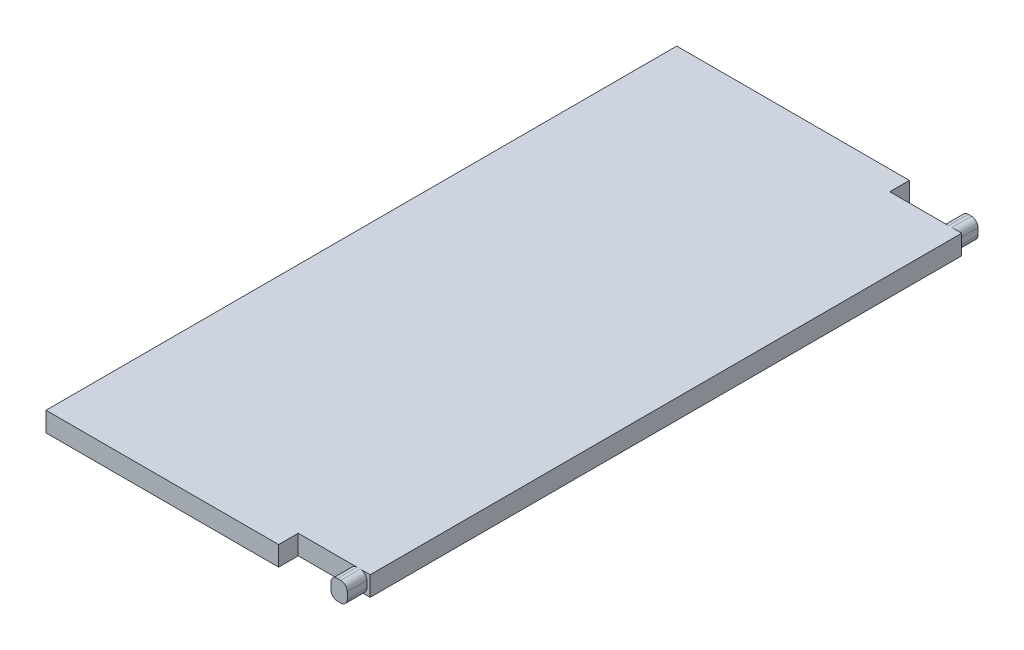
ISO-10303-21;
HEADER;
FILE_DESCRIPTION(('STEP AP214'),'2;1');
FILE_NAME('part.step','',(''),(''),'','','');
FILE_SCHEMA(('AUTOMOTIVE_DESIGN { 1 0 10303 214 1 1 1 1 }'));
ENDSEC;
DATA;
#1=APPLICATION_CONTEXT('core data for automotive mechanical design processes');
#2=APPLICATION_PROTOCOL_DEFINITION('international standard','automotive_design',2000,#1);
#3=PRODUCT_CONTEXT('',#1,'mechanical');
#4=PRODUCT('Part','Part','',(#3));
#5=PRODUCT_RELATED_PRODUCT_CATEGORY('part','',(#4));
#6=PRODUCT_DEFINITION_FORMATION('','',#4);
#7=PRODUCT_DEFINITION_CONTEXT('part definition',#1,'design');
#8=PRODUCT_DEFINITION('design','',#6,#7);
#9=PRODUCT_DEFINITION_SHAPE('','',#8);
#10=(LENGTH_UNIT() NAMED_UNIT(*) SI_UNIT(.MILLI.,.METRE.));
#11=(NAMED_UNIT(*) PLANE_ANGLE_UNIT() SI_UNIT($,.RADIAN.));
#12=(NAMED_UNIT(*) SI_UNIT($,.STERADIAN.) SOLID_ANGLE_UNIT());
#13=UNCERTAINTY_MEASURE_WITH_UNIT(LENGTH_MEASURE(1.E-05),#10,'distance_accuracy_value','');
#14=(GEOMETRIC_REPRESENTATION_CONTEXT(3) GLOBAL_UNCERTAINTY_ASSIGNED_CONTEXT((#13)) GLOBAL_UNIT_ASSIGNED_CONTEXT((#10,
#11,#12)) REPRESENTATION_CONTEXT('',''));
#15=CARTESIAN_POINT('',(0.,0.,0.));
#16=DIRECTION('',(0.,0.,1.));
#17=DIRECTION('',(1.,0.,0.));
#18=AXIS2_PLACEMENT_3D('',#15,#16,#17);
#19=CARTESIAN_POINT('',(0.,3.,0.));
#20=DIRECTION('',(0.,1.,0.));
#21=DIRECTION('',(0.,0.,1.));
#22=AXIS2_PLACEMENT_3D('',#19,#20,#21);
#23=PLANE('',#22);
#24=DIRECTION('',(-1.,0.,0.));
#25=VECTOR('',#24,1.);
#26=CARTESIAN_POINT('',(-31.925,3.,-48.26));
#27=LINE('',#26,#25);
#28=CARTESIAN_POINT('',(20.925,3.,-48.26));
#29=VERTEX_POINT('',#28);
#30=CARTESIAN_POINT('',(-14.675,3.,-48.26));
#31=VERTEX_POINT('',#30);
#32=EDGE_CURVE('E392',#29,#31,#27,.T.);
#33=ORIENTED_EDGE('',*,*,#32,.T.);
#34=DIRECTION('',(0.,0.,-1.));
#35=VECTOR('',#34,1.);
#36=CARTESIAN_POINT('',(-14.675,3.,-48.26));
#37=LINE('',#36,#35);
#38=CARTESIAN_POINT('',(-14.675,3.,48.26));
#39=VERTEX_POINT('',#38);
#40=EDGE_CURVE('E199',#39,#31,#37,.T.);
#41=ORIENTED_EDGE('',*,*,#40,.F.);
#42=DIRECTION('',(1.,0.,0.));
#43=VECTOR('',#42,1.);
#44=CARTESIAN_POINT('',(-31.925,3.,48.26));
#45=LINE('',#44,#43);
#46=CARTESIAN_POINT('',(20.925,3.,48.26));
#47=VERTEX_POINT('',#46);
#48=EDGE_CURVE('E233',#39,#47,#45,.T.);
#49=ORIENTED_EDGE('',*,*,#48,.T.);
#50=DIRECTION('',(0.,0.,1.));
#51=VECTOR('',#50,1.);
#52=CARTESIAN_POINT('',(20.925,3.,45.26));
#53=LINE('',#52,#51);
#54=CARTESIAN_POINT('',(20.925,3.,45.26));
#55=VERTEX_POINT('',#54);
#56=EDGE_CURVE('E382',#55,#47,#53,.T.);
#57=ORIENTED_EDGE('',*,*,#56,.F.);
#58=DIRECTION('',(-1.,0.,0.));
#59=VECTOR('',#58,1.);
#60=CARTESIAN_POINT('',(0.,3.,45.26));
#61=LINE('',#60,#59);
#62=CARTESIAN_POINT('',(29.925,3.,45.26));
#63=VERTEX_POINT('',#62);
#64=EDGE_CURVE('E371',#63,#55,#61,.T.);
#65=ORIENTED_EDGE('',*,*,#64,.F.);
#66=DIRECTION('',(0.,0.,1.));
#67=VECTOR('',#66,1.);
#68=CARTESIAN_POINT('',(29.925,3.,0.));
#69=LINE('',#68,#67);
#70=CARTESIAN_POINT('',(29.925,3.,48.26));
#71=VERTEX_POINT('',#70);
#72=EDGE_CURVE('E252',#63,#71,#69,.T.);
#73=ORIENTED_EDGE('',*,*,#72,.T.);
#74=CARTESIAN_POINT('',(30.425,3.,48.26));
#75=VERTEX_POINT('',#74);
#76=EDGE_CURVE('E395',#71,#75,#45,.T.);
#77=ORIENTED_EDGE('',*,*,#76,.T.);
#78=DIRECTION('',(0.,0.,-1.));
#79=VECTOR('',#78,1.);
#80=CARTESIAN_POINT('',(30.425,3.,0.));
#81=LINE('',#80,#79);
#82=CARTESIAN_POINT('',(30.425,3.,45.26));
#83=VERTEX_POINT('',#82);
#84=EDGE_CURVE('E249',#75,#83,#81,.T.);
#85=ORIENTED_EDGE('',*,*,#84,.T.);
#86=DIRECTION('',(1.,0.,0.));
#87=VECTOR('',#86,1.);
#88=CARTESIAN_POINT('',(-31.925,3.,45.26));
#89=LINE('',#88,#87);
#90=CARTESIAN_POINT('',(31.925,3.,45.26));
#91=VERTEX_POINT('',#90);
#92=EDGE_CURVE('E364',#83,#91,#89,.T.);
#93=ORIENTED_EDGE('',*,*,#92,.T.);
#94=DIRECTION('',(0.,0.,-1.));
#95=VECTOR('',#94,1.);
#96=CARTESIAN_POINT('',(31.925,3.,-48.26));
#97=LINE('',#96,#95);
#98=CARTESIAN_POINT('',(31.925,3.,-45.26));
#99=VERTEX_POINT('',#98);
#100=EDGE_CURVE('E229',#91,#99,#97,.T.);
#101=ORIENTED_EDGE('',*,*,#100,.T.);
#102=DIRECTION('',(1.,0.,0.));
#103=VECTOR('',#102,1.);
#104=CARTESIAN_POINT('',(31.425,3.,-45.26));
#105=LINE('',#104,#103);
#106=CARTESIAN_POINT('',(30.425,3.,-45.26));
#107=VERTEX_POINT('',#106);
#108=EDGE_CURVE('E342',#107,#99,#105,.T.);
#109=ORIENTED_EDGE('',*,*,#108,.F.);
#110=DIRECTION('',(0.,0.,-1.));
#111=VECTOR('',#110,1.);
#112=CARTESIAN_POINT('',(30.425,3.,-48.26));
#113=LINE('',#112,#111);
#114=CARTESIAN_POINT('',(30.425,3.,-48.26));
#115=VERTEX_POINT('',#114);
#116=EDGE_CURVE('E292',#107,#115,#113,.T.);
#117=ORIENTED_EDGE('',*,*,#116,.T.);
#118=CARTESIAN_POINT('',(29.925,3.,-48.26));
#119=VERTEX_POINT('',#118);
#120=EDGE_CURVE('E393',#115,#119,#27,.T.);
#121=ORIENTED_EDGE('',*,*,#120,.T.);
#122=DIRECTION('',(0.,0.,-1.));
#123=VECTOR('',#122,1.);
#124=CARTESIAN_POINT('',(29.925,3.,-45.26));
#125=LINE('',#124,#123);
#126=CARTESIAN_POINT('',(29.925,3.,-45.26));
#127=VERTEX_POINT('',#126);
#128=EDGE_CURVE('E289',#119,#127,#125,.F.);
#129=ORIENTED_EDGE('',*,*,#128,.T.);
#130=DIRECTION('',(-1.,0.,0.));
#131=VECTOR('',#130,1.);
#132=CARTESIAN_POINT('',(0.,3.,-45.26));
#133=LINE('',#132,#131);
#134=CARTESIAN_POINT('',(20.925,3.,-45.26));
#135=VERTEX_POINT('',#134);
#136=EDGE_CURVE('E343',#127,#135,#133,.T.);
#137=ORIENTED_EDGE('',*,*,#136,.T.);
#138=DIRECTION('',(0.,0.,-1.));
#139=VECTOR('',#138,1.);
#140=CARTESIAN_POINT('',(20.925,3.,-45.26));
#141=LINE('',#140,#139);
#142=EDGE_CURVE('E352',#135,#29,#141,.T.);
#143=ORIENTED_EDGE('',*,*,#142,.T.);
#144=EDGE_LOOP('',(#33,#41,#49,#57,#65,#73,#77,#85,#93,#101,#109,#117,#121,#129,#137,#143));
#145=FACE_BOUND('',#144,.T.);
#146=ADVANCED_FACE('F36',(#145),#23,.T.);
#147=CARTESIAN_POINT('',(0.,0.,0.));
#148=DIRECTION('',(0.,1.,0.));
#149=DIRECTION('',(0.,0.,1.));
#150=AXIS2_PLACEMENT_3D('',#147,#148,#149);
#151=PLANE('',#150);
#152=DIRECTION('',(0.,0.,1.));
#153=VECTOR('',#152,1.);
#154=CARTESIAN_POINT('',(-14.675,0.,-48.26));
#155=LINE('',#154,#153);
#156=CARTESIAN_POINT('',(-14.675,0.,-48.26));
#157=VERTEX_POINT('',#156);
#158=CARTESIAN_POINT('',(-14.675,0.,48.26));
#159=VERTEX_POINT('',#158);
#160=EDGE_CURVE('E51',#157,#159,#155,.T.);
#161=ORIENTED_EDGE('',*,*,#160,.F.);
#162=DIRECTION('',(-1.,0.,0.));
#163=VECTOR('',#162,1.);
#164=CARTESIAN_POINT('',(-31.925,0.,-48.26));
#165=LINE('',#164,#163);
#166=CARTESIAN_POINT('',(20.925,0.,-48.26));
#167=VERTEX_POINT('',#166);
#168=EDGE_CURVE('E210',#167,#157,#165,.T.);
#169=ORIENTED_EDGE('',*,*,#168,.F.);
#170=DIRECTION('',(0.,0.,-1.));
#171=VECTOR('',#170,1.);
#172=CARTESIAN_POINT('',(20.925,0.,-45.26));
#173=LINE('',#172,#171);
#174=CARTESIAN_POINT('',(20.925,0.,-45.26));
#175=VERTEX_POINT('',#174);
#176=EDGE_CURVE('E349',#175,#167,#173,.T.);
#177=ORIENTED_EDGE('',*,*,#176,.F.);
#178=DIRECTION('',(1.,0.,0.));
#179=VECTOR('',#178,1.);
#180=CARTESIAN_POINT('',(0.,0.,-45.26));
#181=LINE('',#180,#179);
#182=CARTESIAN_POINT('',(29.925,0.,-45.26));
#183=VERTEX_POINT('',#182);
#184=EDGE_CURVE('E309',#175,#183,#181,.T.);
#185=ORIENTED_EDGE('',*,*,#184,.T.);
#186=DIRECTION('',(0.,0.,-1.));
#187=VECTOR('',#186,1.);
#188=CARTESIAN_POINT('',(29.925,0.,0.));
#189=LINE('',#188,#187);
#190=CARTESIAN_POINT('',(29.925,0.,-48.26));
#191=VERTEX_POINT('',#190);
#192=EDGE_CURVE('E283',#183,#191,#189,.T.);
#193=ORIENTED_EDGE('',*,*,#192,.T.);
#194=CARTESIAN_POINT('',(30.425,0.,-48.26));
#195=VERTEX_POINT('',#194);
#196=EDGE_CURVE('E218',#195,#191,#165,.T.);
#197=ORIENTED_EDGE('',*,*,#196,.F.);
#198=DIRECTION('',(0.,0.,-1.));
#199=VECTOR('',#198,1.);
#200=CARTESIAN_POINT('',(30.425,0.,0.));
#201=LINE('',#200,#199);
#202=CARTESIAN_POINT('',(30.425,0.,-45.26));
#203=VERTEX_POINT('',#202);
#204=EDGE_CURVE('E286',#195,#203,#201,.F.);
#205=ORIENTED_EDGE('',*,*,#204,.T.);
#206=DIRECTION('',(-1.,0.,0.));
#207=VECTOR('',#206,1.);
#208=CARTESIAN_POINT('',(31.925,0.,-45.26));
#209=LINE('',#208,#207);
#210=CARTESIAN_POINT('',(31.925,0.,-45.26));
#211=VERTEX_POINT('',#210);
#212=EDGE_CURVE('E334',#211,#203,#209,.T.);
#213=ORIENTED_EDGE('',*,*,#212,.F.);
#214=DIRECTION('',(0.,0.,-1.));
#215=VECTOR('',#214,1.);
#216=CARTESIAN_POINT('',(31.925,0.,-48.26));
#217=LINE('',#216,#215);
#218=CARTESIAN_POINT('',(31.925,0.,45.26));
#219=VERTEX_POINT('',#218);
#220=EDGE_CURVE('E219',#219,#211,#217,.T.);
#221=ORIENTED_EDGE('',*,*,#220,.F.);
#222=DIRECTION('',(1.,0.,0.));
#223=VECTOR('',#222,1.);
#224=CARTESIAN_POINT('',(-31.925,0.,45.26));
#225=LINE('',#224,#223);
#226=CARTESIAN_POINT('',(30.425,0.,45.26));
#227=VERTEX_POINT('',#226);
#228=EDGE_CURVE('E355',#227,#219,#225,.T.);
#229=ORIENTED_EDGE('',*,*,#228,.F.);
#230=DIRECTION('',(0.,0.,-1.));
#231=VECTOR('',#230,1.);
#232=CARTESIAN_POINT('',(30.425,0.,48.26));
#233=LINE('',#232,#231);
#234=CARTESIAN_POINT('',(30.425,0.,48.26));
#235=VERTEX_POINT('',#234);
#236=EDGE_CURVE('E244',#227,#235,#233,.F.);
#237=ORIENTED_EDGE('',*,*,#236,.T.);
#238=DIRECTION('',(1.,0.,0.));
#239=VECTOR('',#238,1.);
#240=CARTESIAN_POINT('',(-31.925,0.,48.26));
#241=LINE('',#240,#239);
#242=CARTESIAN_POINT('',(29.925,0.,48.26));
#243=VERTEX_POINT('',#242);
#244=EDGE_CURVE('E222',#243,#235,#241,.T.);
#245=ORIENTED_EDGE('',*,*,#244,.F.);
#246=DIRECTION('',(0.,0.,1.));
#247=VECTOR('',#246,1.);
#248=CARTESIAN_POINT('',(29.925,0.,45.26));
#249=LINE('',#248,#247);
#250=CARTESIAN_POINT('',(29.925,0.,45.26));
#251=VERTEX_POINT('',#250);
#252=EDGE_CURVE('E246',#243,#251,#249,.F.);
#253=ORIENTED_EDGE('',*,*,#252,.T.);
#254=DIRECTION('',(1.,0.,0.));
#255=VECTOR('',#254,1.);
#256=CARTESIAN_POINT('',(0.,0.,45.26));
#257=LINE('',#256,#255);
#258=CARTESIAN_POINT('',(20.925,0.,45.26));
#259=VERTEX_POINT('',#258);
#260=EDGE_CURVE('E377',#259,#251,#257,.T.);
#261=ORIENTED_EDGE('',*,*,#260,.F.);
#262=DIRECTION('',(0.,0.,1.));
#263=VECTOR('',#262,1.);
#264=CARTESIAN_POINT('',(20.925,0.,45.26));
#265=LINE('',#264,#263);
#266=CARTESIAN_POINT('',(20.925,0.,48.26));
#267=VERTEX_POINT('',#266);
#268=EDGE_CURVE('E224',#259,#267,#265,.T.);
#269=ORIENTED_EDGE('',*,*,#268,.T.);
#270=EDGE_CURVE('E212',#159,#267,#241,.T.);
#271=ORIENTED_EDGE('',*,*,#270,.F.);
#272=EDGE_LOOP('',(#161,#169,#177,#185,#193,#197,#205,#213,#221,#229,#237,#245,#253,#261,#269,#271));
#273=FACE_BOUND('',#272,.T.);
#274=ADVANCED_FACE('F208',(#273),#151,.F.);
#275=CARTESIAN_POINT('',(-31.925,3.,-48.26));
#276=DIRECTION('',(0.,0.,1.));
#277=DIRECTION('',(1.,0.,0.));
#278=AXIS2_PLACEMENT_3D('',#275,#276,#277);
#279=PLANE('',#278);
#280=DIRECTION('',(0.,-1.,0.));
#281=VECTOR('',#280,1.);
#282=CARTESIAN_POINT('',(-14.675,3.,-48.26));
#283=LINE('',#282,#281);
#284=EDGE_CURVE('E196',#31,#157,#283,.T.);
#285=ORIENTED_EDGE('',*,*,#284,.F.);
#286=ORIENTED_EDGE('',*,*,#32,.F.);
#287=DIRECTION('',(0.,-1.,0.));
#288=VECTOR('',#287,1.);
#289=CARTESIAN_POINT('',(20.925,0.,-48.26));
#290=LINE('',#289,#288);
#291=EDGE_CURVE('E217',#29,#167,#290,.T.);
#292=ORIENTED_EDGE('',*,*,#291,.T.);
#293=ORIENTED_EDGE('',*,*,#168,.T.);
#294=EDGE_LOOP('',(#285,#286,#292,#293));
#295=FACE_BOUND('',#294,.T.);
#296=ADVANCED_FACE('F216',(#295),#279,.F.);
#297=CARTESIAN_POINT('',(-31.925,3.,48.26));
#298=DIRECTION('',(0.,0.,-1.));
#299=DIRECTION('',(-1.,0.,0.));
#300=AXIS2_PLACEMENT_3D('',#297,#298,#299);
#301=PLANE('',#300);
#302=DIRECTION('',(0.,1.,0.));
#303=VECTOR('',#302,1.);
#304=CARTESIAN_POINT('',(-14.675,3.,48.26));
#305=LINE('',#304,#303);
#306=EDGE_CURVE('E213',#159,#39,#305,.T.);
#307=ORIENTED_EDGE('',*,*,#306,.F.);
#308=ORIENTED_EDGE('',*,*,#270,.T.);
#309=DIRECTION('',(0.,-1.,0.));
#310=VECTOR('',#309,1.);
#311=CARTESIAN_POINT('',(20.925,0.,48.26));
#312=LINE('',#311,#310);
#313=EDGE_CURVE('E360',#47,#267,#312,.T.);
#314=ORIENTED_EDGE('',*,*,#313,.F.);
#315=ORIENTED_EDGE('',*,*,#48,.F.);
#316=EDGE_LOOP('',(#307,#308,#314,#315));
#317=FACE_BOUND('',#316,.T.);
#318=ADVANCED_FACE('F432',(#317),#301,.F.);
#319=CARTESIAN_POINT('',(31.925,3.,-48.26));
#320=DIRECTION('',(-1.,0.,0.));
#321=DIRECTION('',(0.,0.,1.));
#322=AXIS2_PLACEMENT_3D('',#319,#320,#321);
#323=PLANE('',#322);
#324=DIRECTION('',(0.,-1.,0.));
#325=VECTOR('',#324,1.);
#326=CARTESIAN_POINT('',(31.925,3.,-45.26));
#327=LINE('',#326,#325);
#328=EDGE_CURVE('E337',#99,#211,#327,.T.);
#329=ORIENTED_EDGE('',*,*,#328,.F.);
#330=ORIENTED_EDGE('',*,*,#100,.F.);
#331=DIRECTION('',(0.,-1.,0.));
#332=VECTOR('',#331,1.);
#333=CARTESIAN_POINT('',(31.925,3.,45.26));
#334=LINE('',#333,#332);
#335=EDGE_CURVE('E366',#91,#219,#334,.T.);
#336=ORIENTED_EDGE('',*,*,#335,.T.);
#337=ORIENTED_EDGE('',*,*,#220,.T.);
#338=EDGE_LOOP('',(#329,#330,#336,#337));
#339=FACE_BOUND('',#338,.T.);
#340=ADVANCED_FACE('F424',(#339),#323,.F.);
#341=DIRECTION('',(0.,-1.,0.));
#342=VECTOR('',#341,1.);
#343=CARTESIAN_POINT('',(28.925,0.,48.26));
#344=LINE('',#343,#342);
#345=CARTESIAN_POINT('',(28.925,2.,48.26));
#346=VERTEX_POINT('',#345);
#347=CARTESIAN_POINT('',(28.925,1.,48.26));
#348=VERTEX_POINT('',#347);
#349=EDGE_CURVE('E375',#346,#348,#344,.T.);
#350=ORIENTED_EDGE('',*,*,#349,.T.);
#351=CARTESIAN_POINT('',(29.925,1.,48.26));
#352=DIRECTION('',(0.,0.,-1.));
#353=DIRECTION('',(-1.,0.,0.));
#354=AXIS2_PLACEMENT_3D('',#351,#352,#353);
#355=CIRCLE('',#354,1.);
#356=EDGE_CURVE('E242',#348,#243,#355,.F.);
#357=ORIENTED_EDGE('',*,*,#356,.T.);
#358=ORIENTED_EDGE('',*,*,#244,.T.);
#359=CARTESIAN_POINT('',(30.425,1.,48.26));
#360=DIRECTION('',(0.,0.,-1.));
#361=DIRECTION('',(-1.,0.,0.));
#362=AXIS2_PLACEMENT_3D('',#359,#360,#361);
#363=CIRCLE('',#362,1.);
#364=CARTESIAN_POINT('',(31.425,1.,48.26));
#365=VERTEX_POINT('',#364);
#366=EDGE_CURVE('E238',#235,#365,#363,.F.);
#367=ORIENTED_EDGE('',*,*,#366,.T.);
#368=DIRECTION('',(0.,1.,0.));
#369=VECTOR('',#368,1.);
#370=CARTESIAN_POINT('',(31.425,3.,48.26));
#371=LINE('',#370,#369);
#372=CARTESIAN_POINT('',(31.425,2.,48.26));
#373=VERTEX_POINT('',#372);
#374=EDGE_CURVE('E361',#365,#373,#371,.T.);
#375=ORIENTED_EDGE('',*,*,#374,.T.);
#376=CARTESIAN_POINT('',(30.425,2.,48.26));
#377=DIRECTION('',(0.,0.,-1.));
#378=DIRECTION('',(-1.,0.,0.));
#379=AXIS2_PLACEMENT_3D('',#376,#377,#378);
#380=CIRCLE('',#379,1.);
#381=EDGE_CURVE('E236',#373,#75,#380,.F.);
#382=ORIENTED_EDGE('',*,*,#381,.T.);
#383=ORIENTED_EDGE('',*,*,#76,.F.);
#384=CARTESIAN_POINT('',(29.925,2.,48.26));
#385=DIRECTION('',(0.,0.,-1.));
#386=DIRECTION('',(-1.,0.,0.));
#387=AXIS2_PLACEMENT_3D('',#384,#385,#386);
#388=CIRCLE('',#387,1.);
#389=EDGE_CURVE('E240',#71,#346,#388,.F.);
#390=ORIENTED_EDGE('',*,*,#389,.T.);
#391=EDGE_LOOP('',(#350,#357,#358,#367,#375,#382,#383,#390));
#392=FACE_BOUND('',#391,.T.);
#393=ADVANCED_FACE('F448',(#392),#301,.F.);
#394=DIRECTION('',(0.,1.,0.));
#395=VECTOR('',#394,1.);
#396=CARTESIAN_POINT('',(31.425,3.,-48.26));
#397=LINE('',#396,#395);
#398=CARTESIAN_POINT('',(31.425,1.,-48.26));
#399=VERTEX_POINT('',#398);
#400=CARTESIAN_POINT('',(31.425,2.,-48.26));
#401=VERTEX_POINT('',#400);
#402=EDGE_CURVE('E320',#399,#401,#397,.T.);
#403=ORIENTED_EDGE('',*,*,#402,.F.);
#404=CARTESIAN_POINT('',(30.425,1.,-48.26));
#405=DIRECTION('',(0.,0.,1.));
#406=DIRECTION('',(1.,0.,0.));
#407=AXIS2_PLACEMENT_3D('',#404,#405,#406);
#408=CIRCLE('',#407,1.);
#409=EDGE_CURVE('E281',#399,#195,#408,.F.);
#410=ORIENTED_EDGE('',*,*,#409,.T.);
#411=ORIENTED_EDGE('',*,*,#196,.T.);
#412=CARTESIAN_POINT('',(29.925,1.,-48.26));
#413=DIRECTION('',(0.,0.,1.));
#414=DIRECTION('',(1.,0.,0.));
#415=AXIS2_PLACEMENT_3D('',#412,#413,#414);
#416=CIRCLE('',#415,1.);
#417=CARTESIAN_POINT('',(28.925,1.,-48.26));
#418=VERTEX_POINT('',#417);
#419=EDGE_CURVE('E277',#191,#418,#416,.F.);
#420=ORIENTED_EDGE('',*,*,#419,.T.);
#421=DIRECTION('',(0.,-1.,0.));
#422=VECTOR('',#421,1.);
#423=CARTESIAN_POINT('',(28.925,0.,-48.26));
#424=LINE('',#423,#422);
#425=CARTESIAN_POINT('',(28.925,2.,-48.26));
#426=VERTEX_POINT('',#425);
#427=EDGE_CURVE('E333',#426,#418,#424,.T.);
#428=ORIENTED_EDGE('',*,*,#427,.F.);
#429=CARTESIAN_POINT('',(29.925,2.,-48.26));
#430=DIRECTION('',(0.,0.,1.));
#431=DIRECTION('',(1.,0.,0.));
#432=AXIS2_PLACEMENT_3D('',#429,#430,#431);
#433=CIRCLE('',#432,1.);
#434=EDGE_CURVE('E275',#426,#119,#433,.F.);
#435=ORIENTED_EDGE('',*,*,#434,.T.);
#436=ORIENTED_EDGE('',*,*,#120,.F.);
#437=CARTESIAN_POINT('',(30.425,2.,-48.26));
#438=DIRECTION('',(0.,0.,1.));
#439=DIRECTION('',(1.,0.,0.));
#440=AXIS2_PLACEMENT_3D('',#437,#438,#439);
#441=CIRCLE('',#440,1.);
#442=EDGE_CURVE('E279',#115,#401,#441,.F.);
#443=ORIENTED_EDGE('',*,*,#442,.T.);
#444=EDGE_LOOP('',(#403,#410,#411,#420,#428,#435,#436,#443));
#445=FACE_BOUND('',#444,.T.);
#446=ADVANCED_FACE('F317',(#445),#279,.F.);
#447=CARTESIAN_POINT('',(28.925,0.,45.26));
#448=DIRECTION('',(-1.,0.,0.));
#449=DIRECTION('',(0.,0.,1.));
#450=AXIS2_PLACEMENT_3D('',#447,#448,#449);
#451=PLANE('',#450);
#452=DIRECTION('',(0.,-1.,0.));
#453=VECTOR('',#452,1.);
#454=CARTESIAN_POINT('',(28.925,0.,45.26));
#455=LINE('',#454,#453);
#456=CARTESIAN_POINT('',(28.925,2.,45.26));
#457=VERTEX_POINT('',#456);
#458=CARTESIAN_POINT('',(28.925,1.,45.26));
#459=VERTEX_POINT('',#458);
#460=EDGE_CURVE('E379',#457,#459,#455,.T.);
#461=ORIENTED_EDGE('',*,*,#460,.T.);
#462=DIRECTION('',(0.,0.,1.));
#463=VECTOR('',#462,1.);
#464=CARTESIAN_POINT('',(28.925,1.,48.26));
#465=LINE('',#464,#463);
#466=EDGE_CURVE('E232',#459,#348,#465,.T.);
#467=ORIENTED_EDGE('',*,*,#466,.T.);
#468=ORIENTED_EDGE('',*,*,#349,.F.);
#469=DIRECTION('',(0.,0.,1.));
#470=VECTOR('',#469,1.);
#471=CARTESIAN_POINT('',(28.925,2.,45.26));
#472=LINE('',#471,#470);
#473=EDGE_CURVE('E230',#346,#457,#472,.F.);
#474=ORIENTED_EDGE('',*,*,#473,.T.);
#475=EDGE_LOOP('',(#461,#467,#468,#474));
#476=FACE_BOUND('',#475,.T.);
#477=ADVANCED_FACE('F450',(#476),#451,.T.);
#478=CARTESIAN_POINT('',(20.925,0.,45.26));
#479=DIRECTION('',(-1.,0.,0.));
#480=DIRECTION('',(0.,-1.,0.));
#481=AXIS2_PLACEMENT_3D('',#478,#479,#480);
#482=PLANE('',#481);
#483=ORIENTED_EDGE('',*,*,#313,.T.);
#484=ORIENTED_EDGE('',*,*,#268,.F.);
#485=DIRECTION('',(0.,-1.,0.));
#486=VECTOR('',#485,1.);
#487=CARTESIAN_POINT('',(20.925,0.,45.26));
#488=LINE('',#487,#486);
#489=EDGE_CURVE('E374',#55,#259,#488,.T.);
#490=ORIENTED_EDGE('',*,*,#489,.F.);
#491=ORIENTED_EDGE('',*,*,#56,.T.);
#492=EDGE_LOOP('',(#483,#484,#490,#491));
#493=FACE_BOUND('',#492,.T.);
#494=ADVANCED_FACE('F435',(#493),#482,.F.);
#495=CARTESIAN_POINT('',(0.,0.,45.26));
#496=DIRECTION('',(0.,0.,1.));
#497=DIRECTION('',(1.,0.,0.));
#498=AXIS2_PLACEMENT_3D('',#495,#496,#497);
#499=PLANE('',#498);
#500=ORIENTED_EDGE('',*,*,#64,.T.);
#501=ORIENTED_EDGE('',*,*,#489,.T.);
#502=ORIENTED_EDGE('',*,*,#260,.T.);
#503=CARTESIAN_POINT('',(29.925,1.,45.26));
#504=DIRECTION('',(0.,0.,1.));
#505=DIRECTION('',(1.,0.,0.));
#506=AXIS2_PLACEMENT_3D('',#503,#504,#505);
#507=CIRCLE('',#506,1.);
#508=EDGE_CURVE('E260',#251,#459,#507,.F.);
#509=ORIENTED_EDGE('',*,*,#508,.T.);
#510=ORIENTED_EDGE('',*,*,#460,.F.);
#511=CARTESIAN_POINT('',(29.925,2.,45.26));
#512=DIRECTION('',(0.,0.,1.));
#513=DIRECTION('',(1.,0.,0.));
#514=AXIS2_PLACEMENT_3D('',#511,#512,#513);
#515=CIRCLE('',#514,1.);
#516=EDGE_CURVE('E262',#457,#63,#515,.F.);
#517=ORIENTED_EDGE('',*,*,#516,.T.);
#518=EDGE_LOOP('',(#500,#501,#502,#509,#510,#517));
#519=FACE_BOUND('',#518,.T.);
#520=ADVANCED_FACE('F441',(#519),#499,.T.);
#521=CARTESIAN_POINT('',(31.425,3.,192.968396979063));
#522=DIRECTION('',(1.,0.,0.));
#523=DIRECTION('',(0.,0.,-1.));
#524=AXIS2_PLACEMENT_3D('',#521,#522,#523);
#525=PLANE('',#524);
#526=ORIENTED_EDGE('',*,*,#374,.F.);
#527=DIRECTION('',(0.,0.,-1.));
#528=VECTOR('',#527,1.);
#529=CARTESIAN_POINT('',(31.425,1.,45.26));
#530=LINE('',#529,#528);
#531=CARTESIAN_POINT('',(31.425,1.,45.26));
#532=VERTEX_POINT('',#531);
#533=EDGE_CURVE('E257',#365,#532,#530,.T.);
#534=ORIENTED_EDGE('',*,*,#533,.T.);
#535=DIRECTION('',(0.,1.,0.));
#536=VECTOR('',#535,1.);
#537=CARTESIAN_POINT('',(31.425,3.,45.26));
#538=LINE('',#537,#536);
#539=CARTESIAN_POINT('',(31.425,2.,45.26));
#540=VERTEX_POINT('',#539);
#541=EDGE_CURVE('E357',#532,#540,#538,.T.);
#542=ORIENTED_EDGE('',*,*,#541,.T.);
#543=DIRECTION('',(0.,0.,-1.));
#544=VECTOR('',#543,1.);
#545=CARTESIAN_POINT('',(31.425,2.,192.968396979063));
#546=LINE('',#545,#544);
#547=EDGE_CURVE('E255',#540,#373,#546,.F.);
#548=ORIENTED_EDGE('',*,*,#547,.T.);
#549=EDGE_LOOP('',(#526,#534,#542,#548));
#550=FACE_BOUND('',#549,.T.);
#551=ADVANCED_FACE('F414',(#550),#525,.T.);
#552=CARTESIAN_POINT('',(-31.925,3.,45.26));
#553=DIRECTION('',(0.,0.,-1.));
#554=DIRECTION('',(-1.,0.,0.));
#555=AXIS2_PLACEMENT_3D('',#552,#553,#554);
#556=PLANE('',#555);
#557=ORIENTED_EDGE('',*,*,#92,.F.);
#558=CARTESIAN_POINT('',(30.425,2.,45.26));
#559=DIRECTION('',(0.,0.,-1.));
#560=DIRECTION('',(-1.,0.,0.));
#561=AXIS2_PLACEMENT_3D('',#558,#559,#560);
#562=CIRCLE('',#561,1.);
#563=EDGE_CURVE('E268',#83,#540,#562,.T.);
#564=ORIENTED_EDGE('',*,*,#563,.T.);
#565=ORIENTED_EDGE('',*,*,#541,.F.);
#566=CARTESIAN_POINT('',(30.425,1.,45.26));
#567=DIRECTION('',(0.,0.,-1.));
#568=DIRECTION('',(-1.,0.,0.));
#569=AXIS2_PLACEMENT_3D('',#566,#567,#568);
#570=CIRCLE('',#569,1.);
#571=EDGE_CURVE('E265',#532,#227,#570,.T.);
#572=ORIENTED_EDGE('',*,*,#571,.T.);
#573=ORIENTED_EDGE('',*,*,#228,.T.);
#574=ORIENTED_EDGE('',*,*,#335,.F.);
#575=EDGE_LOOP('',(#557,#564,#565,#572,#573,#574));
#576=FACE_BOUND('',#575,.T.);
#577=ADVANCED_FACE('F411',(#576),#556,.F.);
#578=CARTESIAN_POINT('',(20.925,0.,-45.26));
#579=DIRECTION('',(1.,0.,0.));
#580=DIRECTION('',(0.,1.,0.));
#581=AXIS2_PLACEMENT_3D('',#578,#579,#580);
#582=PLANE('',#581);
#583=ORIENTED_EDGE('',*,*,#291,.F.);
#584=ORIENTED_EDGE('',*,*,#142,.F.);
#585=DIRECTION('',(0.,-1.,0.));
#586=VECTOR('',#585,1.);
#587=CARTESIAN_POINT('',(20.925,0.,-45.26));
#588=LINE('',#587,#586);
#589=EDGE_CURVE('E348',#135,#175,#588,.T.);
#590=ORIENTED_EDGE('',*,*,#589,.T.);
#591=ORIENTED_EDGE('',*,*,#176,.T.);
#592=EDGE_LOOP('',(#583,#584,#590,#591));
#593=FACE_BOUND('',#592,.T.);
#594=ADVANCED_FACE('F517',(#593),#582,.T.);
#595=CARTESIAN_POINT('',(28.925,0.,-45.26));
#596=DIRECTION('',(1.,0.,0.));
#597=DIRECTION('',(0.,0.,-1.));
#598=AXIS2_PLACEMENT_3D('',#595,#596,#597);
#599=PLANE('',#598);
#600=ORIENTED_EDGE('',*,*,#427,.T.);
#601=DIRECTION('',(0.,0.,-1.));
#602=VECTOR('',#601,1.);
#603=CARTESIAN_POINT('',(28.925,1.,-45.26));
#604=LINE('',#603,#602);
#605=CARTESIAN_POINT('',(28.925,1.,-45.26));
#606=VERTEX_POINT('',#605);
#607=EDGE_CURVE('E59',#418,#606,#604,.F.);
#608=ORIENTED_EDGE('',*,*,#607,.T.);
#609=DIRECTION('',(0.,-1.,0.));
#610=VECTOR('',#609,1.);
#611=CARTESIAN_POINT('',(28.925,0.,-45.26));
#612=LINE('',#611,#610);
#613=CARTESIAN_POINT('',(28.925,2.,-45.26));
#614=VERTEX_POINT('',#613);
#615=EDGE_CURVE('E310',#614,#606,#612,.T.);
#616=ORIENTED_EDGE('',*,*,#615,.F.);
#617=DIRECTION('',(0.,0.,-1.));
#618=VECTOR('',#617,1.);
#619=CARTESIAN_POINT('',(28.925,2.,-48.26));
#620=LINE('',#619,#618);
#621=EDGE_CURVE('E295',#614,#426,#620,.T.);
#622=ORIENTED_EDGE('',*,*,#621,.T.);
#623=EDGE_LOOP('',(#600,#608,#616,#622));
#624=FACE_BOUND('',#623,.T.);
#625=ADVANCED_FACE('F523',(#624),#599,.F.);
#626=CARTESIAN_POINT('',(0.,0.,-45.26));
#627=DIRECTION('',(0.,0.,-1.));
#628=DIRECTION('',(1.,0.,0.));
#629=AXIS2_PLACEMENT_3D('',#626,#627,#628);
#630=PLANE('',#629);
#631=ORIENTED_EDGE('',*,*,#136,.F.);
#632=CARTESIAN_POINT('',(29.925,2.,-45.26));
#633=DIRECTION('',(0.,0.,-1.));
#634=DIRECTION('',(-1.,0.,0.));
#635=AXIS2_PLACEMENT_3D('',#632,#633,#634);
#636=CIRCLE('',#635,1.);
#637=EDGE_CURVE('E11',#127,#614,#636,.F.);
#638=ORIENTED_EDGE('',*,*,#637,.T.);
#639=ORIENTED_EDGE('',*,*,#615,.T.);
#640=CARTESIAN_POINT('',(29.925,1.,-45.26));
#641=DIRECTION('',(0.,0.,-1.));
#642=DIRECTION('',(-1.,0.,0.));
#643=AXIS2_PLACEMENT_3D('',#640,#641,#642);
#644=CIRCLE('',#643,1.);
#645=EDGE_CURVE('E44',#606,#183,#644,.F.);
#646=ORIENTED_EDGE('',*,*,#645,.T.);
#647=ORIENTED_EDGE('',*,*,#184,.F.);
#648=ORIENTED_EDGE('',*,*,#589,.F.);
#649=EDGE_LOOP('',(#631,#638,#639,#646,#647,#648));
#650=FACE_BOUND('',#649,.T.);
#651=ADVANCED_FACE('F308',(#650),#630,.T.);
#652=CARTESIAN_POINT('',(31.425,3.,-45.26));
#653=DIRECTION('',(-1.,0.,0.));
#654=DIRECTION('',(0.,0.,1.));
#655=AXIS2_PLACEMENT_3D('',#652,#653,#654);
#656=PLANE('',#655);
#657=DIRECTION('',(0.,1.,0.));
#658=VECTOR('',#657,1.);
#659=CARTESIAN_POINT('',(31.425,3.,-45.26));
#660=LINE('',#659,#658);
#661=CARTESIAN_POINT('',(31.425,1.,-45.26));
#662=VERTEX_POINT('',#661);
#663=CARTESIAN_POINT('',(31.425,2.,-45.26));
#664=VERTEX_POINT('',#663);
#665=EDGE_CURVE('E330',#662,#664,#660,.T.);
#666=ORIENTED_EDGE('',*,*,#665,.F.);
#667=DIRECTION('',(0.,0.,-1.));
#668=VECTOR('',#667,1.);
#669=CARTESIAN_POINT('',(31.425,1.,-45.26));
#670=LINE('',#669,#668);
#671=EDGE_CURVE('E272',#662,#399,#670,.T.);
#672=ORIENTED_EDGE('',*,*,#671,.T.);
#673=ORIENTED_EDGE('',*,*,#402,.T.);
#674=DIRECTION('',(0.,0.,-1.));
#675=VECTOR('',#674,1.);
#676=CARTESIAN_POINT('',(31.425,2.,-45.26));
#677=LINE('',#676,#675);
#678=EDGE_CURVE('E270',#401,#664,#677,.F.);
#679=ORIENTED_EDGE('',*,*,#678,.T.);
#680=EDGE_LOOP('',(#666,#672,#673,#679));
#681=FACE_BOUND('',#680,.T.);
#682=ADVANCED_FACE('F327',(#681),#656,.F.);
#683=CARTESIAN_POINT('',(0.,0.,-45.26));
#684=DIRECTION('',(0.,0.,-1.));
#685=DIRECTION('',(-1.,0.,0.));
#686=AXIS2_PLACEMENT_3D('',#683,#684,#685);
#687=PLANE('',#686);
#688=ORIENTED_EDGE('',*,*,#108,.T.);
#689=ORIENTED_EDGE('',*,*,#328,.T.);
#690=ORIENTED_EDGE('',*,*,#212,.T.);
#691=CARTESIAN_POINT('',(30.425,1.,-45.26));
#692=DIRECTION('',(0.,0.,-1.));
#693=DIRECTION('',(-1.,0.,0.));
#694=AXIS2_PLACEMENT_3D('',#691,#692,#693);
#695=CIRCLE('',#694,1.);
#696=EDGE_CURVE('E299',#203,#662,#695,.F.);
#697=ORIENTED_EDGE('',*,*,#696,.T.);
#698=ORIENTED_EDGE('',*,*,#665,.T.);
#699=CARTESIAN_POINT('',(30.425,2.,-45.26));
#700=DIRECTION('',(0.,0.,-1.));
#701=DIRECTION('',(-1.,0.,0.));
#702=AXIS2_PLACEMENT_3D('',#699,#700,#701);
#703=CIRCLE('',#702,1.);
#704=EDGE_CURVE('E301',#664,#107,#703,.F.);
#705=ORIENTED_EDGE('',*,*,#704,.T.);
#706=EDGE_LOOP('',(#688,#689,#690,#697,#698,#705));
#707=FACE_BOUND('',#706,.T.);
#708=ADVANCED_FACE('F426',(#707),#687,.T.);
#709=CARTESIAN_POINT('',(29.925,1.,45.26));
#710=DIRECTION('',(0.,0.,-1.));
#711=DIRECTION('',(-1.,0.,0.));
#712=AXIS2_PLACEMENT_3D('',#709,#710,#711);
#713=CYLINDRICAL_SURFACE('',#712,1.);
#714=ORIENTED_EDGE('',*,*,#508,.F.);
#715=ORIENTED_EDGE('',*,*,#252,.F.);
#716=ORIENTED_EDGE('',*,*,#356,.F.);
#717=ORIENTED_EDGE('',*,*,#466,.F.);
#718=EDGE_LOOP('',(#714,#715,#716,#717));
#719=FACE_BOUND('',#718,.T.);
#720=ADVANCED_FACE('F453',(#719),#713,.T.);
#721=CARTESIAN_POINT('',(29.925,2.,0.));
#722=DIRECTION('',(0.,0.,1.));
#723=DIRECTION('',(1.,0.,0.));
#724=AXIS2_PLACEMENT_3D('',#721,#722,#723);
#725=CYLINDRICAL_SURFACE('',#724,1.);
#726=ORIENTED_EDGE('',*,*,#516,.F.);
#727=ORIENTED_EDGE('',*,*,#473,.F.);
#728=ORIENTED_EDGE('',*,*,#389,.F.);
#729=ORIENTED_EDGE('',*,*,#72,.F.);
#730=EDGE_LOOP('',(#726,#727,#728,#729));
#731=FACE_BOUND('',#730,.T.);
#732=ADVANCED_FACE('F446',(#731),#725,.T.);
#733=CARTESIAN_POINT('',(30.425,1.,192.968396979063));
#734=DIRECTION('',(0.,0.,1.));
#735=DIRECTION('',(1.,0.,0.));
#736=AXIS2_PLACEMENT_3D('',#733,#734,#735);
#737=CYLINDRICAL_SURFACE('',#736,1.);
#738=ORIENTED_EDGE('',*,*,#366,.F.);
#739=ORIENTED_EDGE('',*,*,#236,.F.);
#740=ORIENTED_EDGE('',*,*,#571,.F.);
#741=ORIENTED_EDGE('',*,*,#533,.F.);
#742=EDGE_LOOP('',(#738,#739,#740,#741));
#743=FACE_BOUND('',#742,.T.);
#744=ADVANCED_FACE('F418',(#743),#737,.T.);
#745=CARTESIAN_POINT('',(30.425,2.,0.));
#746=DIRECTION('',(0.,0.,-1.));
#747=DIRECTION('',(-1.,0.,0.));
#748=AXIS2_PLACEMENT_3D('',#745,#746,#747);
#749=CYLINDRICAL_SURFACE('',#748,1.);
#750=ORIENTED_EDGE('',*,*,#381,.F.);
#751=ORIENTED_EDGE('',*,*,#547,.F.);
#752=ORIENTED_EDGE('',*,*,#563,.F.);
#753=ORIENTED_EDGE('',*,*,#84,.F.);
#754=EDGE_LOOP('',(#750,#751,#752,#753));
#755=FACE_BOUND('',#754,.T.);
#756=ADVANCED_FACE('F407',(#755),#749,.T.);
#757=CARTESIAN_POINT('',(30.425,1.,-45.26));
#758=DIRECTION('',(0.,0.,-1.));
#759=DIRECTION('',(-1.,0.,0.));
#760=AXIS2_PLACEMENT_3D('',#757,#758,#759);
#761=CYLINDRICAL_SURFACE('',#760,1.);
#762=ORIENTED_EDGE('',*,*,#696,.F.);
#763=ORIENTED_EDGE('',*,*,#204,.F.);
#764=ORIENTED_EDGE('',*,*,#409,.F.);
#765=ORIENTED_EDGE('',*,*,#671,.F.);
#766=EDGE_LOOP('',(#762,#763,#764,#765));
#767=FACE_BOUND('',#766,.T.);
#768=ADVANCED_FACE('F324',(#767),#761,.T.);
#769=CARTESIAN_POINT('',(30.425,2.,0.));
#770=DIRECTION('',(0.,0.,1.));
#771=DIRECTION('',(1.,0.,0.));
#772=AXIS2_PLACEMENT_3D('',#769,#770,#771);
#773=CYLINDRICAL_SURFACE('',#772,1.);
#774=ORIENTED_EDGE('',*,*,#704,.F.);
#775=ORIENTED_EDGE('',*,*,#678,.F.);
#776=ORIENTED_EDGE('',*,*,#442,.F.);
#777=ORIENTED_EDGE('',*,*,#116,.F.);
#778=EDGE_LOOP('',(#774,#775,#776,#777));
#779=FACE_BOUND('',#778,.T.);
#780=ADVANCED_FACE('F556',(#779),#773,.T.);
#781=CARTESIAN_POINT('',(29.925,1.,0.));
#782=DIRECTION('',(0.,0.,-1.));
#783=DIRECTION('',(-1.,0.,0.));
#784=AXIS2_PLACEMENT_3D('',#781,#782,#783);
#785=CYLINDRICAL_SURFACE('',#784,1.);
#786=ORIENTED_EDGE('',*,*,#645,.F.);
#787=ORIENTED_EDGE('',*,*,#607,.F.);
#788=ORIENTED_EDGE('',*,*,#419,.F.);
#789=ORIENTED_EDGE('',*,*,#192,.F.);
#790=EDGE_LOOP('',(#786,#787,#788,#789));
#791=FACE_BOUND('',#790,.T.);
#792=ADVANCED_FACE('F312',(#791),#785,.T.);
#793=CARTESIAN_POINT('',(29.925,2.,-45.26));
#794=DIRECTION('',(0.,0.,1.));
#795=DIRECTION('',(1.,0.,0.));
#796=AXIS2_PLACEMENT_3D('',#793,#794,#795);
#797=CYLINDRICAL_SURFACE('',#796,1.);
#798=ORIENTED_EDGE('',*,*,#637,.F.);
#799=ORIENTED_EDGE('',*,*,#128,.F.);
#800=ORIENTED_EDGE('',*,*,#434,.F.);
#801=ORIENTED_EDGE('',*,*,#621,.F.);
#802=EDGE_LOOP('',(#798,#799,#800,#801));
#803=FACE_BOUND('',#802,.T.);
#804=ADVANCED_FACE('F38',(#803),#797,.T.);
#805=CARTESIAN_POINT('',(-14.675,0.,0.));
#806=DIRECTION('',(-1.,0.,0.));
#807=DIRECTION('',(0.,0.,1.));
#808=AXIS2_PLACEMENT_3D('',#805,#806,#807);
#809=PLANE('',#808);
#810=ORIENTED_EDGE('',*,*,#284,.T.);
#811=ORIENTED_EDGE('',*,*,#160,.T.);
#812=ORIENTED_EDGE('',*,*,#306,.T.);
#813=ORIENTED_EDGE('',*,*,#40,.T.);
#814=EDGE_LOOP('',(#810,#811,#812,#813));
#815=FACE_BOUND('',#814,.T.);
#816=ADVANCED_FACE('F197',(#815),#809,.T.);
#817=CLOSED_SHELL('',(#146,#274,#296,#318,#340,#393,#446,#477,#494,#520,#551,#577,#594,#625,
#651,#682,#708,#720,#732,#744,#756,#768,#780,#792,#804,#816));
#818=MANIFOLD_SOLID_BREP('B2',#817);
#819=ADVANCED_BREP_SHAPE_REPRESENTATION('',(#18,#818),#14);
#820=SHAPE_DEFINITION_REPRESENTATION(#9,#819);
ENDSEC;
END-ISO-10303-21;
